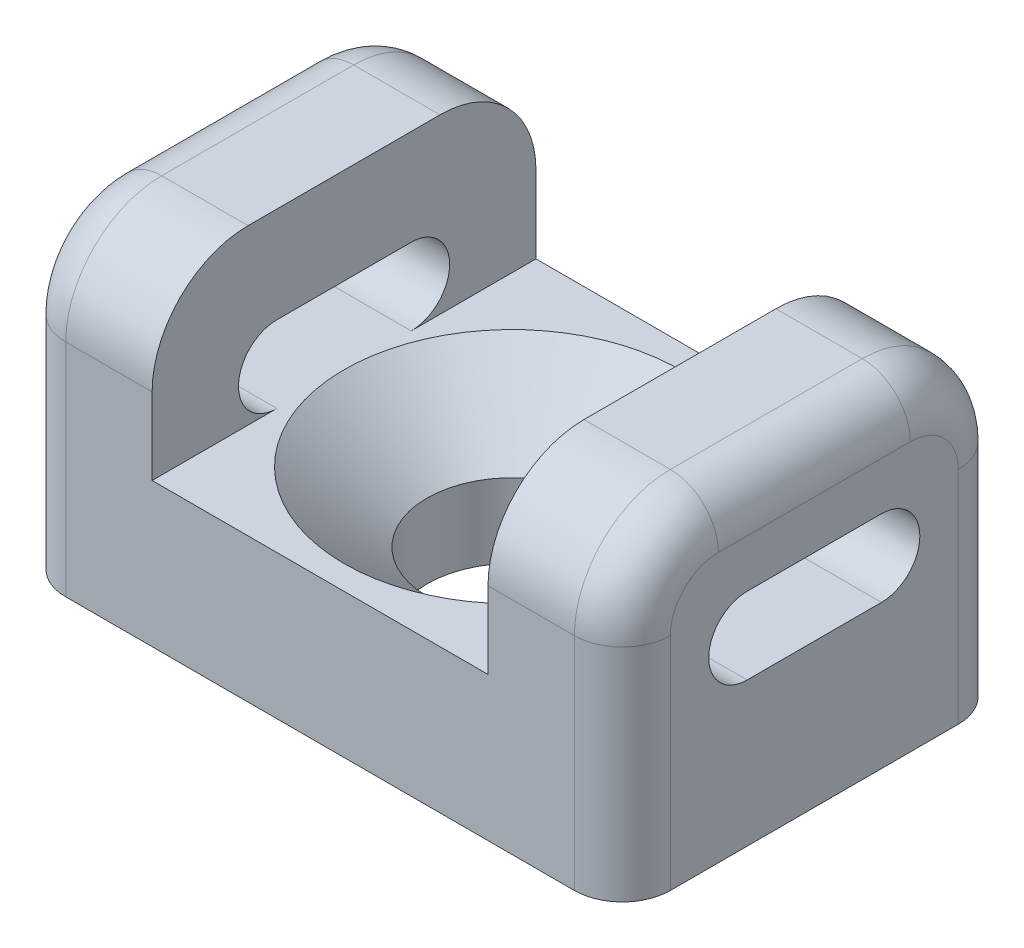
ISO-10303-21;
HEADER;
FILE_DESCRIPTION(('STEP AP214'),'2;1');
FILE_NAME('part.step','',(''),(''),'','','');
FILE_SCHEMA(('AUTOMOTIVE_DESIGN { 1 0 10303 214 1 1 1 1 }'));
ENDSEC;
DATA;
#1=APPLICATION_CONTEXT('core data for automotive mechanical design processes');
#2=APPLICATION_PROTOCOL_DEFINITION('international standard','automotive_design',2000,#1);
#3=PRODUCT_CONTEXT('',#1,'mechanical');
#4=PRODUCT('Part','Part','',(#3));
#5=PRODUCT_RELATED_PRODUCT_CATEGORY('part','',(#4));
#6=PRODUCT_DEFINITION_FORMATION('','',#4);
#7=PRODUCT_DEFINITION_CONTEXT('part definition',#1,'design');
#8=PRODUCT_DEFINITION('design','',#6,#7);
#9=PRODUCT_DEFINITION_SHAPE('','',#8);
#10=(LENGTH_UNIT() NAMED_UNIT(*) SI_UNIT(.MILLI.,.METRE.));
#11=(NAMED_UNIT(*) PLANE_ANGLE_UNIT() SI_UNIT($,.RADIAN.));
#12=(NAMED_UNIT(*) SI_UNIT($,.STERADIAN.) SOLID_ANGLE_UNIT());
#13=UNCERTAINTY_MEASURE_WITH_UNIT(LENGTH_MEASURE(1.E-05),#10,'distance_accuracy_value','');
#14=(GEOMETRIC_REPRESENTATION_CONTEXT(3) GLOBAL_UNCERTAINTY_ASSIGNED_CONTEXT((#13)) GLOBAL_UNIT_ASSIGNED_CONTEXT((#10,
#11,#12)) REPRESENTATION_CONTEXT('',''));
#15=CARTESIAN_POINT('',(0.,0.,0.));
#16=DIRECTION('',(0.,0.,1.));
#17=DIRECTION('',(1.,0.,0.));
#18=AXIS2_PLACEMENT_3D('',#15,#16,#17);
#19=CARTESIAN_POINT('',(0.,0.,5.08));
#20=DIRECTION('',(0.,-1.,0.));
#21=DIRECTION('',(0.,0.,-1.));
#22=AXIS2_PLACEMENT_3D('',#19,#20,#21);
#23=PLANE('',#22);
#24=DIRECTION('',(-1.,0.,0.));
#25=VECTOR('',#24,1.);
#26=CARTESIAN_POINT('',(0.,0.,-5.08));
#27=LINE('',#26,#25);
#28=CARTESIAN_POINT('',(4.445,0.,-5.08));
#29=VERTEX_POINT('',#28);
#30=CARTESIAN_POINT('',(-4.445,0.,-5.08));
#31=VERTEX_POINT('',#30);
#32=EDGE_CURVE('E363',#29,#31,#27,.T.);
#33=ORIENTED_EDGE('',*,*,#32,.T.);
#34=DIRECTION('',(0.,0.,-1.));
#35=VECTOR('',#34,1.);
#36=CARTESIAN_POINT('',(-4.445,0.,5.08));
#37=LINE('',#36,#35);
#38=CARTESIAN_POINT('',(-4.445,0.,-1.778));
#39=VERTEX_POINT('',#38);
#40=EDGE_CURVE('E236',#39,#31,#37,.T.);
#41=ORIENTED_EDGE('',*,*,#40,.F.);
#42=DIRECTION('',(1.,0.,0.));
#43=VECTOR('',#42,1.);
#44=CARTESIAN_POINT('',(-8.001,0.,-1.778));
#45=LINE('',#44,#43);
#46=CARTESIAN_POINT('',(-8.001,0.,-1.778));
#47=VERTEX_POINT('',#46);
#48=EDGE_CURVE('E216',#47,#39,#45,.T.);
#49=ORIENTED_EDGE('',*,*,#48,.F.);
#50=DIRECTION('',(0.,0.,1.));
#51=VECTOR('',#50,1.);
#52=CARTESIAN_POINT('',(-8.001,0.,-1.778));
#53=LINE('',#52,#51);
#54=CARTESIAN_POINT('',(-8.001,0.,1.778));
#55=VERTEX_POINT('',#54);
#56=EDGE_CURVE('E222',#47,#55,#53,.T.);
#57=ORIENTED_EDGE('',*,*,#56,.T.);
#58=DIRECTION('',(1.,0.,0.));
#59=VECTOR('',#58,1.);
#60=CARTESIAN_POINT('',(-8.001,0.,1.778));
#61=LINE('',#60,#59);
#62=CARTESIAN_POINT('',(-4.445,0.,1.778));
#63=VERTEX_POINT('',#62);
#64=EDGE_CURVE('E237',#55,#63,#61,.T.);
#65=ORIENTED_EDGE('',*,*,#64,.T.);
#66=CARTESIAN_POINT('',(-4.445,0.,5.08));
#67=VERTEX_POINT('',#66);
#68=EDGE_CURVE('E251',#67,#63,#37,.T.);
#69=ORIENTED_EDGE('',*,*,#68,.F.);
#70=DIRECTION('',(-1.,0.,0.));
#71=VECTOR('',#70,1.);
#72=CARTESIAN_POINT('',(0.,0.,5.08));
#73=LINE('',#72,#71);
#74=CARTESIAN_POINT('',(4.445,0.,5.08));
#75=VERTEX_POINT('',#74);
#76=EDGE_CURVE('E365',#75,#67,#73,.T.);
#77=ORIENTED_EDGE('',*,*,#76,.F.);
#78=DIRECTION('',(0.,0.,-1.));
#79=VECTOR('',#78,1.);
#80=CARTESIAN_POINT('',(4.445,0.,5.08));
#81=LINE('',#80,#79);
#82=CARTESIAN_POINT('',(4.445,0.,1.778));
#83=VERTEX_POINT('',#82);
#84=EDGE_CURVE('E373',#75,#83,#81,.T.);
#85=ORIENTED_EDGE('',*,*,#84,.T.);
#86=DIRECTION('',(-1.,0.,0.));
#87=VECTOR('',#86,1.);
#88=CARTESIAN_POINT('',(8.001,0.,1.778));
#89=LINE('',#88,#87);
#90=CARTESIAN_POINT('',(8.001,0.,1.778));
#91=VERTEX_POINT('',#90);
#92=EDGE_CURVE('E347',#91,#83,#89,.T.);
#93=ORIENTED_EDGE('',*,*,#92,.F.);
#94=DIRECTION('',(0.,0.,1.));
#95=VECTOR('',#94,1.);
#96=CARTESIAN_POINT('',(8.001,0.,-1.778));
#97=LINE('',#96,#95);
#98=CARTESIAN_POINT('',(8.001,0.,-1.778));
#99=VERTEX_POINT('',#98);
#100=EDGE_CURVE('E324',#99,#91,#97,.T.);
#101=ORIENTED_EDGE('',*,*,#100,.F.);
#102=DIRECTION('',(-1.,0.,0.));
#103=VECTOR('',#102,1.);
#104=CARTESIAN_POINT('',(8.001,0.,-1.778));
#105=LINE('',#104,#103);
#106=CARTESIAN_POINT('',(4.445,0.,-1.778));
#107=VERTEX_POINT('',#106);
#108=EDGE_CURVE('E334',#99,#107,#105,.T.);
#109=ORIENTED_EDGE('',*,*,#108,.T.);
#110=EDGE_CURVE('E367',#107,#29,#81,.T.);
#111=ORIENTED_EDGE('',*,*,#110,.T.);
#112=EDGE_LOOP('',(#33,#41,#49,#57,#65,#69,#77,#85,#93,#101,#109,#111));
#113=FACE_BOUND('',#112,.T.);
#114=CARTESIAN_POINT('',(0.,0.,0.));
#115=DIRECTION('',(0.,1.,0.));
#116=DIRECTION('',(0.,0.,1.));
#117=AXIS2_PLACEMENT_3D('',#114,#115,#116);
#118=CIRCLE('',#117,4.445);
#119=CARTESIAN_POINT('',(0.,0.,4.445));
#120=VERTEX_POINT('',#119);
#121=EDGE_CURVE('E344',#120,#120,#118,.T.);
#122=ORIENTED_EDGE('',*,*,#121,.F.);
#123=EDGE_LOOP('',(#122));
#124=FACE_BOUND('',#123,.T.);
#125=ADVANCED_FACE('F37',(#113,#124),#23,.F.);
#126=CARTESIAN_POINT('',(8.001,-3.81,5.08));
#127=DIRECTION('',(0.,1.,0.));
#128=DIRECTION('',(-1.,0.,0.));
#129=AXIS2_PLACEMENT_3D('',#126,#127,#128);
#130=PLANE('',#129);
#131=CARTESIAN_POINT('',(-6.731,-3.81,-3.81));
#132=DIRECTION('',(0.,-1.,0.));
#133=DIRECTION('',(1.,0.,0.));
#134=AXIS2_PLACEMENT_3D('',#131,#132,#133);
#135=CIRCLE('',#134,1.27);
#136=CARTESIAN_POINT('',(-6.731,-3.81,-5.08));
#137=VERTEX_POINT('',#136);
#138=CARTESIAN_POINT('',(-8.001,-3.81,-3.81));
#139=VERTEX_POINT('',#138);
#140=EDGE_CURVE('E296',#137,#139,#135,.F.);
#141=ORIENTED_EDGE('',*,*,#140,.F.);
#142=DIRECTION('',(1.,0.,0.));
#143=VECTOR('',#142,1.);
#144=CARTESIAN_POINT('',(8.001,-3.81,-5.08));
#145=LINE('',#144,#143);
#146=CARTESIAN_POINT('',(6.731,-3.81,-5.08));
#147=VERTEX_POINT('',#146);
#148=EDGE_CURVE('E359',#137,#147,#145,.T.);
#149=ORIENTED_EDGE('',*,*,#148,.T.);
#150=CARTESIAN_POINT('',(6.731,-3.81,-3.81));
#151=DIRECTION('',(0.,1.,0.));
#152=DIRECTION('',(-1.,0.,0.));
#153=AXIS2_PLACEMENT_3D('',#150,#151,#152);
#154=CIRCLE('',#153,1.27);
#155=CARTESIAN_POINT('',(8.001,-3.81,-3.81));
#156=VERTEX_POINT('',#155);
#157=EDGE_CURVE('E410',#147,#156,#154,.F.);
#158=ORIENTED_EDGE('',*,*,#157,.T.);
#159=DIRECTION('',(0.,0.,-1.));
#160=VECTOR('',#159,1.);
#161=CARTESIAN_POINT('',(8.001,-3.81,5.08));
#162=LINE('',#161,#160);
#163=CARTESIAN_POINT('',(8.001,-3.81,3.81));
#164=VERTEX_POINT('',#163);
#165=EDGE_CURVE('E379',#164,#156,#162,.T.);
#166=ORIENTED_EDGE('',*,*,#165,.F.);
#167=CARTESIAN_POINT('',(6.731,-3.81,3.81));
#168=DIRECTION('',(0.,1.,0.));
#169=DIRECTION('',(-1.,0.,0.));
#170=AXIS2_PLACEMENT_3D('',#167,#168,#169);
#171=CIRCLE('',#170,1.27);
#172=CARTESIAN_POINT('',(6.731,-3.81,5.08));
#173=VERTEX_POINT('',#172);
#174=EDGE_CURVE('E408',#164,#173,#171,.F.);
#175=ORIENTED_EDGE('',*,*,#174,.T.);
#176=DIRECTION('',(1.,0.,0.));
#177=VECTOR('',#176,1.);
#178=CARTESIAN_POINT('',(8.001,-3.81,5.08));
#179=LINE('',#178,#177);
#180=CARTESIAN_POINT('',(-6.731,-3.81,5.08));
#181=VERTEX_POINT('',#180);
#182=EDGE_CURVE('E360',#181,#173,#179,.T.);
#183=ORIENTED_EDGE('',*,*,#182,.F.);
#184=CARTESIAN_POINT('',(-6.731,-3.81,3.81));
#185=DIRECTION('',(0.,-1.,0.));
#186=DIRECTION('',(1.,0.,0.));
#187=AXIS2_PLACEMENT_3D('',#184,#185,#186);
#188=CIRCLE('',#187,1.27);
#189=CARTESIAN_POINT('',(-8.001,-3.81,3.81));
#190=VERTEX_POINT('',#189);
#191=EDGE_CURVE('E293',#190,#181,#188,.F.);
#192=ORIENTED_EDGE('',*,*,#191,.F.);
#193=DIRECTION('',(0.,0.,-1.));
#194=VECTOR('',#193,1.);
#195=CARTESIAN_POINT('',(-8.001,-3.81,5.08));
#196=LINE('',#195,#194);
#197=EDGE_CURVE('E257',#190,#139,#196,.T.);
#198=ORIENTED_EDGE('',*,*,#197,.T.);
#199=EDGE_LOOP('',(#141,#149,#158,#166,#175,#183,#192,#198));
#200=FACE_BOUND('',#199,.T.);
#201=CARTESIAN_POINT('',(0.,-3.81,0.));
#202=DIRECTION('',(0.,1.,0.));
#203=DIRECTION('',(0.,0.,1.));
#204=AXIS2_PLACEMENT_3D('',#201,#202,#203);
#205=CIRCLE('',#204,2.2479);
#206=CARTESIAN_POINT('',(0.,-3.81,2.2479));
#207=VERTEX_POINT('',#206);
#208=EDGE_CURVE('E356',#207,#207,#205,.T.);
#209=ORIENTED_EDGE('',*,*,#208,.T.);
#210=EDGE_LOOP('',(#209));
#211=FACE_BOUND('',#210,.T.);
#212=ADVANCED_FACE('F440',(#200,#211),#130,.F.);
#213=CARTESIAN_POINT('',(8.001,4.572,5.08));
#214=DIRECTION('',(-1.,0.,0.));
#215=DIRECTION('',(0.,-1.,0.));
#216=AXIS2_PLACEMENT_3D('',#213,#214,#215);
#217=PLANE('',#216);
#218=DIRECTION('',(0.,0.,-1.));
#219=VECTOR('',#218,1.);
#220=CARTESIAN_POINT('',(8.001,2.032,-1.778));
#221=LINE('',#220,#219);
#222=CARTESIAN_POINT('',(8.001,2.032,1.778));
#223=VERTEX_POINT('',#222);
#224=CARTESIAN_POINT('',(8.001,2.032,-1.778));
#225=VERTEX_POINT('',#224);
#226=EDGE_CURVE('E331',#223,#225,#221,.T.);
#227=ORIENTED_EDGE('',*,*,#226,.T.);
#228=CARTESIAN_POINT('',(8.001,1.016,-1.778));
#229=DIRECTION('',(-1.,0.,0.));
#230=DIRECTION('',(0.,0.,1.));
#231=AXIS2_PLACEMENT_3D('',#228,#229,#230);
#232=CIRCLE('',#231,1.016);
#233=EDGE_CURVE('E321',#225,#99,#232,.T.);
#234=ORIENTED_EDGE('',*,*,#233,.T.);
#235=ORIENTED_EDGE('',*,*,#100,.T.);
#236=CARTESIAN_POINT('',(8.001,1.016,1.778));
#237=DIRECTION('',(-1.,0.,0.));
#238=DIRECTION('',(0.,0.,1.));
#239=AXIS2_PLACEMENT_3D('',#236,#237,#238);
#240=CIRCLE('',#239,1.016);
#241=EDGE_CURVE('E328',#91,#223,#240,.T.);
#242=ORIENTED_EDGE('',*,*,#241,.T.);
#243=EDGE_LOOP('',(#227,#234,#235,#242));
#244=FACE_BOUND('',#243,.T.);
#245=ORIENTED_EDGE('',*,*,#165,.T.);
#246=DIRECTION('',(0.,1.,0.));
#247=VECTOR('',#246,1.);
#248=CARTESIAN_POINT('',(8.001,2.032,-3.81));
#249=LINE('',#248,#247);
#250=CARTESIAN_POINT('',(8.001,2.032,-3.81));
#251=VERTEX_POINT('',#250);
#252=EDGE_CURVE('E403',#156,#251,#249,.T.);
#253=ORIENTED_EDGE('',*,*,#252,.T.);
#254=CARTESIAN_POINT('',(8.001,2.032,-2.54));
#255=DIRECTION('',(-1.,0.,0.));
#256=DIRECTION('',(0.,-1.,0.));
#257=AXIS2_PLACEMENT_3D('',#254,#255,#256);
#258=CIRCLE('',#257,1.27);
#259=CARTESIAN_POINT('',(8.001,3.302,-2.54));
#260=VERTEX_POINT('',#259);
#261=EDGE_CURVE('E401',#251,#260,#258,.F.);
#262=ORIENTED_EDGE('',*,*,#261,.T.);
#263=DIRECTION('',(0.,0.,-1.));
#264=VECTOR('',#263,1.);
#265=CARTESIAN_POINT('',(8.001,3.302,5.08));
#266=LINE('',#265,#264);
#267=CARTESIAN_POINT('',(8.001,3.302,2.54));
#268=VERTEX_POINT('',#267);
#269=EDGE_CURVE('E399',#260,#268,#266,.F.);
#270=ORIENTED_EDGE('',*,*,#269,.T.);
#271=CARTESIAN_POINT('',(8.001,2.032,2.54));
#272=DIRECTION('',(-1.,0.,0.));
#273=DIRECTION('',(0.,-1.,0.));
#274=AXIS2_PLACEMENT_3D('',#271,#272,#273);
#275=CIRCLE('',#274,1.27);
#276=CARTESIAN_POINT('',(8.001,2.032,3.81));
#277=VERTEX_POINT('',#276);
#278=EDGE_CURVE('E397',#268,#277,#275,.F.);
#279=ORIENTED_EDGE('',*,*,#278,.T.);
#280=DIRECTION('',(0.,1.,0.));
#281=VECTOR('',#280,1.);
#282=CARTESIAN_POINT('',(8.001,4.572,3.81));
#283=LINE('',#282,#281);
#284=EDGE_CURVE('E395',#277,#164,#283,.F.);
#285=ORIENTED_EDGE('',*,*,#284,.T.);
#286=EDGE_LOOP('',(#245,#253,#262,#270,#279,#285));
#287=FACE_BOUND('',#286,.T.);
#288=ADVANCED_FACE('F436',(#244,#287),#217,.F.);
#289=CARTESIAN_POINT('',(4.445,4.572,5.08));
#290=DIRECTION('',(0.,-1.,0.));
#291=DIRECTION('',(0.,0.,-1.));
#292=AXIS2_PLACEMENT_3D('',#289,#290,#291);
#293=PLANE('',#292);
#294=DIRECTION('',(-1.,0.,0.));
#295=VECTOR('',#294,1.);
#296=CARTESIAN_POINT('',(4.445,4.572,2.54));
#297=LINE('',#296,#295);
#298=CARTESIAN_POINT('',(4.445,4.572,2.54));
#299=VERTEX_POINT('',#298);
#300=CARTESIAN_POINT('',(6.731,4.572,2.54));
#301=VERTEX_POINT('',#300);
#302=EDGE_CURVE('E382',#299,#301,#297,.F.);
#303=ORIENTED_EDGE('',*,*,#302,.T.);
#304=DIRECTION('',(0.,0.,-1.));
#305=VECTOR('',#304,1.);
#306=CARTESIAN_POINT('',(6.731,4.572,5.08));
#307=LINE('',#306,#305);
#308=CARTESIAN_POINT('',(6.731,4.572,-2.54));
#309=VERTEX_POINT('',#308);
#310=EDGE_CURVE('E414',#301,#309,#307,.T.);
#311=ORIENTED_EDGE('',*,*,#310,.T.);
#312=DIRECTION('',(-1.,0.,0.));
#313=VECTOR('',#312,1.);
#314=CARTESIAN_POINT('',(4.445,4.572,-2.54));
#315=LINE('',#314,#313);
#316=CARTESIAN_POINT('',(4.445,4.572,-2.54));
#317=VERTEX_POINT('',#316);
#318=EDGE_CURVE('E384',#309,#317,#315,.T.);
#319=ORIENTED_EDGE('',*,*,#318,.T.);
#320=DIRECTION('',(0.,0.,-1.));
#321=VECTOR('',#320,1.);
#322=CARTESIAN_POINT('',(4.445,4.572,5.08));
#323=LINE('',#322,#321);
#324=EDGE_CURVE('E376',#299,#317,#323,.T.);
#325=ORIENTED_EDGE('',*,*,#324,.F.);
#326=EDGE_LOOP('',(#303,#311,#319,#325));
#327=FACE_BOUND('',#326,.T.);
#328=ADVANCED_FACE('F483',(#327),#293,.F.);
#329=CARTESIAN_POINT('',(4.445,0.,5.08));
#330=DIRECTION('',(1.,0.,0.));
#331=DIRECTION('',(0.,0.,-1.));
#332=AXIS2_PLACEMENT_3D('',#329,#330,#331);
#333=PLANE('',#332);
#334=ORIENTED_EDGE('',*,*,#324,.T.);
#335=CARTESIAN_POINT('',(4.445,2.032,-2.54));
#336=DIRECTION('',(1.,0.,0.));
#337=DIRECTION('',(0.,0.,-1.));
#338=AXIS2_PLACEMENT_3D('',#335,#336,#337);
#339=CIRCLE('',#338,2.54);
#340=CARTESIAN_POINT('',(4.445,2.032,-5.08));
#341=VERTEX_POINT('',#340);
#342=EDGE_CURVE('E388',#317,#341,#339,.F.);
#343=ORIENTED_EDGE('',*,*,#342,.T.);
#344=DIRECTION('',(0.,-1.,0.));
#345=VECTOR('',#344,1.);
#346=CARTESIAN_POINT('',(4.445,0.,-5.08));
#347=LINE('',#346,#345);
#348=EDGE_CURVE('E370',#341,#29,#347,.T.);
#349=ORIENTED_EDGE('',*,*,#348,.T.);
#350=ORIENTED_EDGE('',*,*,#110,.F.);
#351=CARTESIAN_POINT('',(4.445,1.016,-1.778));
#352=DIRECTION('',(-1.,0.,0.));
#353=DIRECTION('',(0.,0.,1.));
#354=AXIS2_PLACEMENT_3D('',#351,#352,#353);
#355=CIRCLE('',#354,1.016);
#356=CARTESIAN_POINT('',(4.445,2.032,-1.778));
#357=VERTEX_POINT('',#356);
#358=EDGE_CURVE('E335',#357,#107,#355,.T.);
#359=ORIENTED_EDGE('',*,*,#358,.F.);
#360=DIRECTION('',(0.,0.,-1.));
#361=VECTOR('',#360,1.);
#362=CARTESIAN_POINT('',(4.445,2.032,-1.778));
#363=LINE('',#362,#361);
#364=CARTESIAN_POINT('',(4.445,2.032,1.778));
#365=VERTEX_POINT('',#364);
#366=EDGE_CURVE('E325',#365,#357,#363,.T.);
#367=ORIENTED_EDGE('',*,*,#366,.F.);
#368=CARTESIAN_POINT('',(4.445,1.016,1.778));
#369=DIRECTION('',(-1.,0.,0.));
#370=DIRECTION('',(0.,0.,1.));
#371=AXIS2_PLACEMENT_3D('',#368,#369,#370);
#372=CIRCLE('',#371,1.016);
#373=EDGE_CURVE('E337',#83,#365,#372,.T.);
#374=ORIENTED_EDGE('',*,*,#373,.F.);
#375=ORIENTED_EDGE('',*,*,#84,.F.);
#376=DIRECTION('',(0.,-1.,0.));
#377=VECTOR('',#376,1.);
#378=CARTESIAN_POINT('',(4.445,0.,5.08));
#379=LINE('',#378,#377);
#380=CARTESIAN_POINT('',(4.445,2.032,5.08));
#381=VERTEX_POINT('',#380);
#382=EDGE_CURVE('E362',#381,#75,#379,.T.);
#383=ORIENTED_EDGE('',*,*,#382,.F.);
#384=CARTESIAN_POINT('',(4.445,2.032,2.54));
#385=DIRECTION('',(1.,0.,0.));
#386=DIRECTION('',(0.,0.,-1.));
#387=AXIS2_PLACEMENT_3D('',#384,#385,#386);
#388=CIRCLE('',#387,2.54);
#389=EDGE_CURVE('E386',#381,#299,#388,.F.);
#390=ORIENTED_EDGE('',*,*,#389,.T.);
#391=EDGE_LOOP('',(#334,#343,#349,#350,#359,#367,#374,#375,#383,#390));
#392=FACE_BOUND('',#391,.T.);
#393=ADVANCED_FACE('F465',(#392),#333,.F.);
#394=CARTESIAN_POINT('',(0.,0.,5.08));
#395=DIRECTION('',(0.,0.,-1.));
#396=DIRECTION('',(-1.,0.,0.));
#397=AXIS2_PLACEMENT_3D('',#394,#395,#396);
#398=PLANE('',#397);
#399=ORIENTED_EDGE('',*,*,#182,.T.);
#400=DIRECTION('',(0.,1.,0.));
#401=VECTOR('',#400,1.);
#402=CARTESIAN_POINT('',(6.731,0.,5.08));
#403=LINE('',#402,#401);
#404=CARTESIAN_POINT('',(6.731,2.032,5.08));
#405=VERTEX_POINT('',#404);
#406=EDGE_CURVE('E11',#173,#405,#403,.T.);
#407=ORIENTED_EDGE('',*,*,#406,.T.);
#408=DIRECTION('',(-1.,0.,0.));
#409=VECTOR('',#408,1.);
#410=CARTESIAN_POINT('',(0.,2.032,5.08));
#411=LINE('',#410,#409);
#412=EDGE_CURVE('E393',#405,#381,#411,.T.);
#413=ORIENTED_EDGE('',*,*,#412,.T.);
#414=ORIENTED_EDGE('',*,*,#382,.T.);
#415=ORIENTED_EDGE('',*,*,#76,.T.);
#416=DIRECTION('',(0.,-1.,0.));
#417=VECTOR('',#416,1.);
#418=CARTESIAN_POINT('',(-4.445,0.,5.08));
#419=LINE('',#418,#417);
#420=CARTESIAN_POINT('',(-4.445,2.032,5.08));
#421=VERTEX_POINT('',#420);
#422=EDGE_CURVE('E245',#421,#67,#419,.T.);
#423=ORIENTED_EDGE('',*,*,#422,.F.);
#424=DIRECTION('',(1.,0.,0.));
#425=VECTOR('',#424,1.);
#426=CARTESIAN_POINT('',(0.,2.032,5.08));
#427=LINE('',#426,#425);
#428=CARTESIAN_POINT('',(-6.731,2.032,5.08));
#429=VERTEX_POINT('',#428);
#430=EDGE_CURVE('E274',#429,#421,#427,.T.);
#431=ORIENTED_EDGE('',*,*,#430,.F.);
#432=DIRECTION('',(0.,1.,0.));
#433=VECTOR('',#432,1.);
#434=CARTESIAN_POINT('',(-6.731,0.,5.08));
#435=LINE('',#434,#433);
#436=EDGE_CURVE('E308',#181,#429,#435,.T.);
#437=ORIENTED_EDGE('',*,*,#436,.F.);
#438=EDGE_LOOP('',(#399,#407,#413,#414,#415,#423,#431,#437));
#439=FACE_BOUND('',#438,.T.);
#440=ADVANCED_FACE('F500',(#439),#398,.F.);
#441=CARTESIAN_POINT('',(0.,0.,-5.08));
#442=DIRECTION('',(0.,0.,-1.));
#443=DIRECTION('',(-1.,0.,0.));
#444=AXIS2_PLACEMENT_3D('',#441,#442,#443);
#445=PLANE('',#444);
#446=DIRECTION('',(-1.,0.,0.));
#447=VECTOR('',#446,1.);
#448=CARTESIAN_POINT('',(8.001,2.032,-5.08));
#449=LINE('',#448,#447);
#450=CARTESIAN_POINT('',(6.731,2.032,-5.08));
#451=VERTEX_POINT('',#450);
#452=EDGE_CURVE('E390',#341,#451,#449,.F.);
#453=ORIENTED_EDGE('',*,*,#452,.T.);
#454=DIRECTION('',(0.,1.,0.));
#455=VECTOR('',#454,1.);
#456=CARTESIAN_POINT('',(6.731,-3.81,-5.08));
#457=LINE('',#456,#455);
#458=EDGE_CURVE('E406',#451,#147,#457,.F.);
#459=ORIENTED_EDGE('',*,*,#458,.T.);
#460=ORIENTED_EDGE('',*,*,#148,.F.);
#461=DIRECTION('',(0.,1.,0.));
#462=VECTOR('',#461,1.);
#463=CARTESIAN_POINT('',(-6.731,-3.81,-5.08));
#464=LINE('',#463,#462);
#465=CARTESIAN_POINT('',(-6.731,2.032,-5.08));
#466=VERTEX_POINT('',#465);
#467=EDGE_CURVE('E290',#466,#137,#464,.F.);
#468=ORIENTED_EDGE('',*,*,#467,.F.);
#469=DIRECTION('',(1.,0.,0.));
#470=VECTOR('',#469,1.);
#471=CARTESIAN_POINT('',(-8.001,2.032,-5.08));
#472=LINE('',#471,#470);
#473=CARTESIAN_POINT('',(-4.445,2.032,-5.08));
#474=VERTEX_POINT('',#473);
#475=EDGE_CURVE('E271',#474,#466,#472,.F.);
#476=ORIENTED_EDGE('',*,*,#475,.F.);
#477=DIRECTION('',(0.,-1.,0.));
#478=VECTOR('',#477,1.);
#479=CARTESIAN_POINT('',(-4.445,0.,-5.08));
#480=LINE('',#479,#478);
#481=EDGE_CURVE('E248',#474,#31,#480,.T.);
#482=ORIENTED_EDGE('',*,*,#481,.T.);
#483=ORIENTED_EDGE('',*,*,#32,.F.);
#484=ORIENTED_EDGE('',*,*,#348,.F.);
#485=EDGE_LOOP('',(#453,#459,#460,#468,#476,#482,#483,#484));
#486=FACE_BOUND('',#485,.T.);
#487=ADVANCED_FACE('F460',(#486),#445,.T.);
#488=CARTESIAN_POINT('',(0.,0.,0.));
#489=DIRECTION('',(0.,1.,0.));
#490=DIRECTION('',(0.,0.,1.));
#491=AXIS2_PLACEMENT_3D('',#488,#489,#490);
#492=CYLINDRICAL_SURFACE('',#491,2.24789999999999);
#493=CARTESIAN_POINT('',(0.,-1.8435857996596,0.));
#494=DIRECTION('',(0.,1.,0.));
#495=DIRECTION('',(0.,0.,1.));
#496=AXIS2_PLACEMENT_3D('',#493,#494,#495);
#497=CIRCLE('',#496,2.24789999999999);
#498=CARTESIAN_POINT('',(0.,-1.8435857996596,2.24789999999999));
#499=VERTEX_POINT('',#498);
#500=EDGE_CURVE('E353',#499,#499,#497,.T.);
#501=ORIENTED_EDGE('',*,*,#500,.T.);
#502=EDGE_LOOP('',(#501));
#503=FACE_BOUND('',#502,.T.);
#504=ORIENTED_EDGE('',*,*,#208,.F.);
#505=EDGE_LOOP('',(#504));
#506=FACE_BOUND('',#505,.T.);
#507=ADVANCED_FACE('F507',(#503,#506),#492,.F.);
#508=CARTESIAN_POINT('',(0.,0.,0.));
#509=DIRECTION('',(0.,1.,0.));
#510=DIRECTION('',(0.,0.,1.));
#511=AXIS2_PLACEMENT_3D('',#508,#509,#510);
#512=CONICAL_SURFACE('',#511,4.445,0.872664625997168);
#513=ORIENTED_EDGE('',*,*,#121,.T.);
#514=EDGE_LOOP('',(#513));
#515=FACE_BOUND('',#514,.T.);
#516=ORIENTED_EDGE('',*,*,#500,.F.);
#517=EDGE_LOOP('',(#516));
#518=FACE_BOUND('',#517,.T.);
#519=ADVANCED_FACE('F511',(#515,#518),#512,.F.);
#520=CARTESIAN_POINT('',(8.001,1.016,-1.778));
#521=DIRECTION('',(-1.,0.,0.));
#522=DIRECTION('',(0.,0.,1.));
#523=AXIS2_PLACEMENT_3D('',#520,#521,#522);
#524=CYLINDRICAL_SURFACE('',#523,1.016);
#525=ORIENTED_EDGE('',*,*,#358,.T.);
#526=ORIENTED_EDGE('',*,*,#108,.F.);
#527=ORIENTED_EDGE('',*,*,#233,.F.);
#528=DIRECTION('',(-1.,0.,0.));
#529=VECTOR('',#528,1.);
#530=CARTESIAN_POINT('',(8.001,2.032,-1.778));
#531=LINE('',#530,#529);
#532=EDGE_CURVE('E342',#225,#357,#531,.T.);
#533=ORIENTED_EDGE('',*,*,#532,.T.);
#534=EDGE_LOOP('',(#525,#526,#527,#533));
#535=FACE_BOUND('',#534,.T.);
#536=ADVANCED_FACE('F471',(#535),#524,.F.);
#537=CARTESIAN_POINT('',(8.001,2.032,-1.778));
#538=DIRECTION('',(0.,1.,0.));
#539=DIRECTION('',(0.,0.,1.));
#540=AXIS2_PLACEMENT_3D('',#537,#538,#539);
#541=PLANE('',#540);
#542=ORIENTED_EDGE('',*,*,#366,.T.);
#543=ORIENTED_EDGE('',*,*,#532,.F.);
#544=ORIENTED_EDGE('',*,*,#226,.F.);
#545=DIRECTION('',(-1.,0.,0.));
#546=VECTOR('',#545,1.);
#547=CARTESIAN_POINT('',(8.001,2.032,1.778));
#548=LINE('',#547,#546);
#549=EDGE_CURVE('E345',#223,#365,#548,.T.);
#550=ORIENTED_EDGE('',*,*,#549,.T.);
#551=EDGE_LOOP('',(#542,#543,#544,#550));
#552=FACE_BOUND('',#551,.T.);
#553=ADVANCED_FACE('F476',(#552),#541,.F.);
#554=CARTESIAN_POINT('',(8.001,1.016,1.778));
#555=DIRECTION('',(-1.,0.,0.));
#556=DIRECTION('',(0.,0.,1.));
#557=AXIS2_PLACEMENT_3D('',#554,#555,#556);
#558=CYLINDRICAL_SURFACE('',#557,1.016);
#559=ORIENTED_EDGE('',*,*,#373,.T.);
#560=ORIENTED_EDGE('',*,*,#549,.F.);
#561=ORIENTED_EDGE('',*,*,#241,.F.);
#562=ORIENTED_EDGE('',*,*,#92,.T.);
#563=EDGE_LOOP('',(#559,#560,#561,#562));
#564=FACE_BOUND('',#563,.T.);
#565=ADVANCED_FACE('F479',(#564),#558,.F.);
#566=CARTESIAN_POINT('',(4.445,2.032,-2.54));
#567=DIRECTION('',(1.,0.,0.));
#568=DIRECTION('',(0.,0.,-1.));
#569=AXIS2_PLACEMENT_3D('',#566,#567,#568);
#570=CYLINDRICAL_SURFACE('',#569,2.54);
#571=ORIENTED_EDGE('',*,*,#318,.F.);
#572=CARTESIAN_POINT('',(6.731,2.032,-2.54));
#573=DIRECTION('',(-1.,0.,0.));
#574=DIRECTION('',(0.,-1.,0.));
#575=AXIS2_PLACEMENT_3D('',#572,#573,#574);
#576=CIRCLE('',#575,2.54);
#577=EDGE_CURVE('E412',#309,#451,#576,.T.);
#578=ORIENTED_EDGE('',*,*,#577,.T.);
#579=ORIENTED_EDGE('',*,*,#452,.F.);
#580=ORIENTED_EDGE('',*,*,#342,.F.);
#581=EDGE_LOOP('',(#571,#578,#579,#580));
#582=FACE_BOUND('',#581,.T.);
#583=ADVANCED_FACE('F456',(#582),#570,.T.);
#584=CARTESIAN_POINT('',(0.,2.032,2.54));
#585=DIRECTION('',(-1.,0.,0.));
#586=DIRECTION('',(0.,0.,1.));
#587=AXIS2_PLACEMENT_3D('',#584,#585,#586);
#588=CYLINDRICAL_SURFACE('',#587,2.54);
#589=ORIENTED_EDGE('',*,*,#412,.F.);
#590=CARTESIAN_POINT('',(6.731,2.032,2.54));
#591=DIRECTION('',(-1.,0.,0.));
#592=DIRECTION('',(0.,-1.,0.));
#593=AXIS2_PLACEMENT_3D('',#590,#591,#592);
#594=CIRCLE('',#593,2.54);
#595=EDGE_CURVE('E46',#405,#301,#594,.T.);
#596=ORIENTED_EDGE('',*,*,#595,.T.);
#597=ORIENTED_EDGE('',*,*,#302,.F.);
#598=ORIENTED_EDGE('',*,*,#389,.F.);
#599=EDGE_LOOP('',(#589,#596,#597,#598));
#600=FACE_BOUND('',#599,.T.);
#601=ADVANCED_FACE('F602',(#600),#588,.T.);
#602=CARTESIAN_POINT('',(6.731,0.,3.81));
#603=DIRECTION('',(0.,1.,0.));
#604=DIRECTION('',(-1.,0.,0.));
#605=AXIS2_PLACEMENT_3D('',#602,#603,#604);
#606=CYLINDRICAL_SURFACE('',#605,1.27);
#607=ORIENTED_EDGE('',*,*,#174,.F.);
#608=ORIENTED_EDGE('',*,*,#284,.F.);
#609=CARTESIAN_POINT('',(6.731,2.032,3.81));
#610=DIRECTION('',(0.,1.,0.));
#611=DIRECTION('',(-1.,0.,0.));
#612=AXIS2_PLACEMENT_3D('',#609,#610,#611);
#613=CIRCLE('',#612,1.27);
#614=EDGE_CURVE('E41',#405,#277,#613,.T.);
#615=ORIENTED_EDGE('',*,*,#614,.F.);
#616=ORIENTED_EDGE('',*,*,#406,.F.);
#617=EDGE_LOOP('',(#607,#608,#615,#616));
#618=FACE_BOUND('',#617,.T.);
#619=ADVANCED_FACE('F39',(#618),#606,.T.);
#620=CARTESIAN_POINT('',(6.731,2.032,2.54));
#621=DIRECTION('',(-1.,0.,0.));
#622=DIRECTION('',(0.,-1.,0.));
#623=AXIS2_PLACEMENT_3D('',#620,#621,#622);
#624=DEGENERATE_TOROIDAL_SURFACE('',#623,1.27,1.27,.T.);
#625=ORIENTED_EDGE('',*,*,#614,.T.);
#626=ORIENTED_EDGE('',*,*,#278,.F.);
#627=CARTESIAN_POINT('',(6.731,3.302,2.54));
#628=DIRECTION('',(0.,0.,-1.));
#629=DIRECTION('',(-1.,0.,0.));
#630=AXIS2_PLACEMENT_3D('',#627,#628,#629);
#631=CIRCLE('',#630,1.27);
#632=EDGE_CURVE('E420',#301,#268,#631,.T.);
#633=ORIENTED_EDGE('',*,*,#632,.F.);
#634=ORIENTED_EDGE('',*,*,#595,.F.);
#635=EDGE_LOOP('',(#625,#626,#633,#634));
#636=FACE_BOUND('',#635,.T.);
#637=ADVANCED_FACE('F430',(#636),#624,.T.);
#638=CARTESIAN_POINT('',(6.731,3.302,5.08));
#639=DIRECTION('',(0.,0.,-1.));
#640=DIRECTION('',(-1.,0.,0.));
#641=AXIS2_PLACEMENT_3D('',#638,#639,#640);
#642=CYLINDRICAL_SURFACE('',#641,1.27);
#643=ORIENTED_EDGE('',*,*,#632,.T.);
#644=ORIENTED_EDGE('',*,*,#269,.F.);
#645=CARTESIAN_POINT('',(6.731,3.302,-2.54));
#646=DIRECTION('',(0.,0.,-1.));
#647=DIRECTION('',(-1.,0.,0.));
#648=AXIS2_PLACEMENT_3D('',#645,#646,#647);
#649=CIRCLE('',#648,1.27);
#650=EDGE_CURVE('E418',#309,#260,#649,.T.);
#651=ORIENTED_EDGE('',*,*,#650,.F.);
#652=ORIENTED_EDGE('',*,*,#310,.F.);
#653=EDGE_LOOP('',(#643,#644,#651,#652));
#654=FACE_BOUND('',#653,.T.);
#655=ADVANCED_FACE('F450',(#654),#642,.T.);
#656=CARTESIAN_POINT('',(6.731,2.032,-2.54));
#657=DIRECTION('',(-1.,0.,0.));
#658=DIRECTION('',(0.,-1.,0.));
#659=AXIS2_PLACEMENT_3D('',#656,#657,#658);
#660=DEGENERATE_TOROIDAL_SURFACE('',#659,1.27,1.27,.T.);
#661=ORIENTED_EDGE('',*,*,#650,.T.);
#662=ORIENTED_EDGE('',*,*,#261,.F.);
#663=CARTESIAN_POINT('',(6.731,2.032,-3.81));
#664=DIRECTION('',(0.,-1.,0.));
#665=DIRECTION('',(1.,0.,0.));
#666=AXIS2_PLACEMENT_3D('',#663,#664,#665);
#667=CIRCLE('',#666,1.27);
#668=EDGE_CURVE('E311',#451,#251,#667,.T.);
#669=ORIENTED_EDGE('',*,*,#668,.F.);
#670=ORIENTED_EDGE('',*,*,#577,.F.);
#671=EDGE_LOOP('',(#661,#662,#669,#670));
#672=FACE_BOUND('',#671,.T.);
#673=ADVANCED_FACE('F452',(#672),#660,.T.);
#674=CARTESIAN_POINT('',(6.731,4.572,-3.81));
#675=DIRECTION('',(0.,-1.,0.));
#676=DIRECTION('',(1.,0.,0.));
#677=AXIS2_PLACEMENT_3D('',#674,#675,#676);
#678=CYLINDRICAL_SURFACE('',#677,1.27);
#679=ORIENTED_EDGE('',*,*,#157,.F.);
#680=ORIENTED_EDGE('',*,*,#458,.F.);
#681=ORIENTED_EDGE('',*,*,#668,.T.);
#682=ORIENTED_EDGE('',*,*,#252,.F.);
#683=EDGE_LOOP('',(#679,#680,#681,#682));
#684=FACE_BOUND('',#683,.T.);
#685=ADVANCED_FACE('F445',(#684),#678,.T.);
#686=CARTESIAN_POINT('',(-8.001,4.572,5.08));
#687=DIRECTION('',(1.,0.,0.));
#688=DIRECTION('',(0.,-1.,0.));
#689=AXIS2_PLACEMENT_3D('',#686,#687,#688);
#690=PLANE('',#689);
#691=DIRECTION('',(0.,0.,-1.));
#692=VECTOR('',#691,1.);
#693=CARTESIAN_POINT('',(-8.001,2.032,-1.778));
#694=LINE('',#693,#692);
#695=CARTESIAN_POINT('',(-8.001,2.032,1.778));
#696=VERTEX_POINT('',#695);
#697=CARTESIAN_POINT('',(-8.001,2.032,-1.778));
#698=VERTEX_POINT('',#697);
#699=EDGE_CURVE('E238',#696,#698,#694,.T.);
#700=ORIENTED_EDGE('',*,*,#699,.F.);
#701=CARTESIAN_POINT('',(-8.001,1.016,1.778));
#702=DIRECTION('',(-1.,0.,0.));
#703=DIRECTION('',(0.,0.,1.));
#704=AXIS2_PLACEMENT_3D('',#701,#702,#703);
#705=CIRCLE('',#704,1.016);
#706=EDGE_CURVE('E229',#55,#696,#705,.T.);
#707=ORIENTED_EDGE('',*,*,#706,.F.);
#708=ORIENTED_EDGE('',*,*,#56,.F.);
#709=CARTESIAN_POINT('',(-8.001,1.016,-1.778));
#710=DIRECTION('',(-1.,0.,0.));
#711=DIRECTION('',(0.,0.,1.));
#712=AXIS2_PLACEMENT_3D('',#709,#710,#711);
#713=CIRCLE('',#712,1.016);
#714=EDGE_CURVE('E211',#698,#47,#713,.T.);
#715=ORIENTED_EDGE('',*,*,#714,.F.);
#716=EDGE_LOOP('',(#700,#707,#708,#715));
#717=FACE_BOUND('',#716,.T.);
#718=ORIENTED_EDGE('',*,*,#197,.F.);
#719=DIRECTION('',(0.,1.,0.));
#720=VECTOR('',#719,1.);
#721=CARTESIAN_POINT('',(-8.001,4.572,3.81));
#722=LINE('',#721,#720);
#723=CARTESIAN_POINT('',(-8.001,2.032,3.81));
#724=VERTEX_POINT('',#723);
#725=EDGE_CURVE('E276',#724,#190,#722,.F.);
#726=ORIENTED_EDGE('',*,*,#725,.F.);
#727=CARTESIAN_POINT('',(-8.001,2.032,2.54));
#728=DIRECTION('',(-1.,0.,0.));
#729=DIRECTION('',(0.,-1.,0.));
#730=AXIS2_PLACEMENT_3D('',#727,#728,#729);
#731=CIRCLE('',#730,1.27);
#732=CARTESIAN_POINT('',(-8.001,3.302,2.54));
#733=VERTEX_POINT('',#732);
#734=EDGE_CURVE('E278',#733,#724,#731,.F.);
#735=ORIENTED_EDGE('',*,*,#734,.F.);
#736=DIRECTION('',(0.,0.,-1.));
#737=VECTOR('',#736,1.);
#738=CARTESIAN_POINT('',(-8.001,3.302,5.08));
#739=LINE('',#738,#737);
#740=CARTESIAN_POINT('',(-8.001,3.302,-2.54));
#741=VERTEX_POINT('',#740);
#742=EDGE_CURVE('E281',#741,#733,#739,.F.);
#743=ORIENTED_EDGE('',*,*,#742,.F.);
#744=CARTESIAN_POINT('',(-8.001,2.032,-2.54));
#745=DIRECTION('',(-1.,0.,0.));
#746=DIRECTION('',(0.,-1.,0.));
#747=AXIS2_PLACEMENT_3D('',#744,#745,#746);
#748=CIRCLE('',#747,1.27);
#749=CARTESIAN_POINT('',(-8.001,2.032,-3.81));
#750=VERTEX_POINT('',#749);
#751=EDGE_CURVE('E284',#750,#741,#748,.F.);
#752=ORIENTED_EDGE('',*,*,#751,.F.);
#753=DIRECTION('',(0.,1.,0.));
#754=VECTOR('',#753,1.);
#755=CARTESIAN_POINT('',(-8.001,2.032,-3.81));
#756=LINE('',#755,#754);
#757=EDGE_CURVE('E287',#139,#750,#756,.T.);
#758=ORIENTED_EDGE('',*,*,#757,.F.);
#759=EDGE_LOOP('',(#718,#726,#735,#743,#752,#758));
#760=FACE_BOUND('',#759,.T.);
#761=ADVANCED_FACE('F226',(#717,#760),#690,.F.);
#762=CARTESIAN_POINT('',(-4.445,4.572,5.08));
#763=DIRECTION('',(0.,-1.,0.));
#764=DIRECTION('',(0.,0.,-1.));
#765=AXIS2_PLACEMENT_3D('',#762,#763,#764);
#766=PLANE('',#765);
#767=DIRECTION('',(1.,0.,0.));
#768=VECTOR('',#767,1.);
#769=CARTESIAN_POINT('',(-4.445,4.572,2.54));
#770=LINE('',#769,#768);
#771=CARTESIAN_POINT('',(-4.445,4.572,2.54));
#772=VERTEX_POINT('',#771);
#773=CARTESIAN_POINT('',(-6.731,4.572,2.54));
#774=VERTEX_POINT('',#773);
#775=EDGE_CURVE('E260',#772,#774,#770,.F.);
#776=ORIENTED_EDGE('',*,*,#775,.F.);
#777=DIRECTION('',(0.,0.,-1.));
#778=VECTOR('',#777,1.);
#779=CARTESIAN_POINT('',(-4.445,4.572,5.08));
#780=LINE('',#779,#778);
#781=CARTESIAN_POINT('',(-4.445,4.572,-2.54));
#782=VERTEX_POINT('',#781);
#783=EDGE_CURVE('E254',#772,#782,#780,.T.);
#784=ORIENTED_EDGE('',*,*,#783,.T.);
#785=DIRECTION('',(1.,0.,0.));
#786=VECTOR('',#785,1.);
#787=CARTESIAN_POINT('',(-4.445,4.572,-2.54));
#788=LINE('',#787,#786);
#789=CARTESIAN_POINT('',(-6.731,4.572,-2.54));
#790=VERTEX_POINT('',#789);
#791=EDGE_CURVE('E263',#790,#782,#788,.T.);
#792=ORIENTED_EDGE('',*,*,#791,.F.);
#793=DIRECTION('',(0.,0.,-1.));
#794=VECTOR('',#793,1.);
#795=CARTESIAN_POINT('',(-6.731,4.572,5.08));
#796=LINE('',#795,#794);
#797=EDGE_CURVE('E302',#774,#790,#796,.T.);
#798=ORIENTED_EDGE('',*,*,#797,.F.);
#799=EDGE_LOOP('',(#776,#784,#792,#798));
#800=FACE_BOUND('',#799,.T.);
#801=ADVANCED_FACE('F553',(#800),#766,.F.);
#802=CARTESIAN_POINT('',(-4.445,0.,5.08));
#803=DIRECTION('',(-1.,0.,0.));
#804=DIRECTION('',(0.,0.,-1.));
#805=AXIS2_PLACEMENT_3D('',#802,#803,#804);
#806=PLANE('',#805);
#807=ORIENTED_EDGE('',*,*,#783,.F.);
#808=CARTESIAN_POINT('',(-4.445,2.032,2.54));
#809=DIRECTION('',(1.,0.,0.));
#810=DIRECTION('',(0.,0.,-1.));
#811=AXIS2_PLACEMENT_3D('',#808,#809,#810);
#812=CIRCLE('',#811,2.54);
#813=EDGE_CURVE('E266',#421,#772,#812,.F.);
#814=ORIENTED_EDGE('',*,*,#813,.F.);
#815=ORIENTED_EDGE('',*,*,#422,.T.);
#816=ORIENTED_EDGE('',*,*,#68,.T.);
#817=CARTESIAN_POINT('',(-4.445,1.016,1.778));
#818=DIRECTION('',(-1.,0.,0.));
#819=DIRECTION('',(0.,0.,1.));
#820=AXIS2_PLACEMENT_3D('',#817,#818,#819);
#821=CIRCLE('',#820,1.016);
#822=CARTESIAN_POINT('',(-4.445,2.032,1.778));
#823=VERTEX_POINT('',#822);
#824=EDGE_CURVE('E574',#63,#823,#821,.T.);
#825=ORIENTED_EDGE('',*,*,#824,.T.);
#826=DIRECTION('',(0.,0.,-1.));
#827=VECTOR('',#826,1.);
#828=CARTESIAN_POINT('',(-4.445,2.032,-1.778));
#829=LINE('',#828,#827);
#830=CARTESIAN_POINT('',(-4.445,2.032,-1.778));
#831=VERTEX_POINT('',#830);
#832=EDGE_CURVE('E223',#823,#831,#829,.T.);
#833=ORIENTED_EDGE('',*,*,#832,.T.);
#834=CARTESIAN_POINT('',(-4.445,1.016,-1.778));
#835=DIRECTION('',(-1.,0.,0.));
#836=DIRECTION('',(0.,0.,1.));
#837=AXIS2_PLACEMENT_3D('',#834,#835,#836);
#838=CIRCLE('',#837,1.016);
#839=EDGE_CURVE('E320',#831,#39,#838,.T.);
#840=ORIENTED_EDGE('',*,*,#839,.T.);
#841=ORIENTED_EDGE('',*,*,#40,.T.);
#842=ORIENTED_EDGE('',*,*,#481,.F.);
#843=CARTESIAN_POINT('',(-4.445,2.032,-2.54));
#844=DIRECTION('',(1.,0.,0.));
#845=DIRECTION('',(0.,0.,-1.));
#846=AXIS2_PLACEMENT_3D('',#843,#844,#845);
#847=CIRCLE('',#846,2.54);
#848=EDGE_CURVE('E268',#782,#474,#847,.F.);
#849=ORIENTED_EDGE('',*,*,#848,.F.);
#850=EDGE_LOOP('',(#807,#814,#815,#816,#825,#833,#840,#841,#842,#849));
#851=FACE_BOUND('',#850,.T.);
#852=ADVANCED_FACE('F556',(#851),#806,.F.);
#853=CARTESIAN_POINT('',(-8.001,1.016,-1.778));
#854=DIRECTION('',(1.,0.,0.));
#855=DIRECTION('',(0.,0.,1.));
#856=AXIS2_PLACEMENT_3D('',#853,#854,#855);
#857=CYLINDRICAL_SURFACE('',#856,1.016);
#858=ORIENTED_EDGE('',*,*,#839,.F.);
#859=DIRECTION('',(1.,0.,0.));
#860=VECTOR('',#859,1.);
#861=CARTESIAN_POINT('',(-8.001,2.032,-1.778));
#862=LINE('',#861,#860);
#863=EDGE_CURVE('E218',#698,#831,#862,.T.);
#864=ORIENTED_EDGE('',*,*,#863,.F.);
#865=ORIENTED_EDGE('',*,*,#714,.T.);
#866=ORIENTED_EDGE('',*,*,#48,.T.);
#867=EDGE_LOOP('',(#858,#864,#865,#866));
#868=FACE_BOUND('',#867,.T.);
#869=ADVANCED_FACE('F214',(#868),#857,.F.);
#870=CARTESIAN_POINT('',(-8.001,2.032,-1.778));
#871=DIRECTION('',(0.,1.,0.));
#872=DIRECTION('',(0.,0.,1.));
#873=AXIS2_PLACEMENT_3D('',#870,#871,#872);
#874=PLANE('',#873);
#875=ORIENTED_EDGE('',*,*,#832,.F.);
#876=DIRECTION('',(1.,0.,0.));
#877=VECTOR('',#876,1.);
#878=CARTESIAN_POINT('',(-8.001,2.032,1.778));
#879=LINE('',#878,#877);
#880=EDGE_CURVE('E240',#696,#823,#879,.T.);
#881=ORIENTED_EDGE('',*,*,#880,.F.);
#882=ORIENTED_EDGE('',*,*,#699,.T.);
#883=ORIENTED_EDGE('',*,*,#863,.T.);
#884=EDGE_LOOP('',(#875,#881,#882,#883));
#885=FACE_BOUND('',#884,.T.);
#886=ADVANCED_FACE('F563',(#885),#874,.F.);
#887=CARTESIAN_POINT('',(-8.001,1.016,1.778));
#888=DIRECTION('',(1.,0.,0.));
#889=DIRECTION('',(0.,0.,1.));
#890=AXIS2_PLACEMENT_3D('',#887,#888,#889);
#891=CYLINDRICAL_SURFACE('',#890,1.016);
#892=ORIENTED_EDGE('',*,*,#824,.F.);
#893=ORIENTED_EDGE('',*,*,#64,.F.);
#894=ORIENTED_EDGE('',*,*,#706,.T.);
#895=ORIENTED_EDGE('',*,*,#880,.T.);
#896=EDGE_LOOP('',(#892,#893,#894,#895));
#897=FACE_BOUND('',#896,.T.);
#898=ADVANCED_FACE('F549',(#897),#891,.F.);
#899=CARTESIAN_POINT('',(-4.445,2.032,-2.54));
#900=DIRECTION('',(-1.,0.,0.));
#901=DIRECTION('',(0.,0.,-1.));
#902=AXIS2_PLACEMENT_3D('',#899,#900,#901);
#903=CYLINDRICAL_SURFACE('',#902,2.54);
#904=ORIENTED_EDGE('',*,*,#791,.T.);
#905=ORIENTED_EDGE('',*,*,#848,.T.);
#906=ORIENTED_EDGE('',*,*,#475,.T.);
#907=CARTESIAN_POINT('',(-6.731,2.032,-2.54));
#908=DIRECTION('',(-1.,0.,0.));
#909=DIRECTION('',(0.,-1.,0.));
#910=AXIS2_PLACEMENT_3D('',#907,#908,#909);
#911=CIRCLE('',#910,2.54);
#912=EDGE_CURVE('E299',#790,#466,#911,.T.);
#913=ORIENTED_EDGE('',*,*,#912,.F.);
#914=EDGE_LOOP('',(#904,#905,#906,#913));
#915=FACE_BOUND('',#914,.T.);
#916=ADVANCED_FACE('F545',(#915),#903,.T.);
#917=CARTESIAN_POINT('',(0.,2.032,2.54));
#918=DIRECTION('',(1.,0.,0.));
#919=DIRECTION('',(0.,0.,1.));
#920=AXIS2_PLACEMENT_3D('',#917,#918,#919);
#921=CYLINDRICAL_SURFACE('',#920,2.54);
#922=ORIENTED_EDGE('',*,*,#430,.T.);
#923=ORIENTED_EDGE('',*,*,#813,.T.);
#924=ORIENTED_EDGE('',*,*,#775,.T.);
#925=CARTESIAN_POINT('',(-6.731,2.032,2.54));
#926=DIRECTION('',(-1.,0.,0.));
#927=DIRECTION('',(0.,-1.,0.));
#928=AXIS2_PLACEMENT_3D('',#925,#926,#927);
#929=CIRCLE('',#928,2.54);
#930=EDGE_CURVE('E305',#429,#774,#929,.T.);
#931=ORIENTED_EDGE('',*,*,#930,.F.);
#932=EDGE_LOOP('',(#922,#923,#924,#931));
#933=FACE_BOUND('',#932,.T.);
#934=ADVANCED_FACE('F526',(#933),#921,.T.);
#935=CARTESIAN_POINT('',(-6.731,0.,3.81));
#936=DIRECTION('',(0.,1.,0.));
#937=DIRECTION('',(1.,0.,0.));
#938=AXIS2_PLACEMENT_3D('',#935,#936,#937);
#939=CYLINDRICAL_SURFACE('',#938,1.27);
#940=ORIENTED_EDGE('',*,*,#191,.T.);
#941=ORIENTED_EDGE('',*,*,#436,.T.);
#942=CARTESIAN_POINT('',(-6.731,2.032,3.81));
#943=DIRECTION('',(0.,-1.,0.));
#944=DIRECTION('',(1.,0.,0.));
#945=AXIS2_PLACEMENT_3D('',#942,#943,#944);
#946=CIRCLE('',#945,1.27);
#947=EDGE_CURVE('E318',#429,#724,#946,.T.);
#948=ORIENTED_EDGE('',*,*,#947,.T.);
#949=ORIENTED_EDGE('',*,*,#725,.T.);
#950=EDGE_LOOP('',(#940,#941,#948,#949));
#951=FACE_BOUND('',#950,.T.);
#952=ADVANCED_FACE('F522',(#951),#939,.T.);
#953=CARTESIAN_POINT('',(-6.731,2.032,2.54));
#954=DIRECTION('',(1.,0.,0.));
#955=DIRECTION('',(0.,-1.,0.));
#956=AXIS2_PLACEMENT_3D('',#953,#954,#955);
#957=DEGENERATE_TOROIDAL_SURFACE('',#956,1.27,1.27,.T.);
#958=ORIENTED_EDGE('',*,*,#947,.F.);
#959=ORIENTED_EDGE('',*,*,#930,.T.);
#960=CARTESIAN_POINT('',(-6.731,3.302,2.54));
#961=DIRECTION('',(0.,0.,1.));
#962=DIRECTION('',(1.,0.,0.));
#963=AXIS2_PLACEMENT_3D('',#960,#961,#962);
#964=CIRCLE('',#963,1.27);
#965=EDGE_CURVE('E316',#774,#733,#964,.T.);
#966=ORIENTED_EDGE('',*,*,#965,.T.);
#967=ORIENTED_EDGE('',*,*,#734,.T.);
#968=EDGE_LOOP('',(#958,#959,#966,#967));
#969=FACE_BOUND('',#968,.T.);
#970=ADVANCED_FACE('F525',(#969),#957,.T.);
#971=CARTESIAN_POINT('',(-6.731,3.302,5.08));
#972=DIRECTION('',(0.,0.,-1.));
#973=DIRECTION('',(1.,0.,0.));
#974=AXIS2_PLACEMENT_3D('',#971,#972,#973);
#975=CYLINDRICAL_SURFACE('',#974,1.27);
#976=ORIENTED_EDGE('',*,*,#965,.F.);
#977=ORIENTED_EDGE('',*,*,#797,.T.);
#978=CARTESIAN_POINT('',(-6.731,3.302,-2.54));
#979=DIRECTION('',(0.,0.,1.));
#980=DIRECTION('',(1.,0.,0.));
#981=AXIS2_PLACEMENT_3D('',#978,#979,#980);
#982=CIRCLE('',#981,1.27);
#983=EDGE_CURVE('E314',#790,#741,#982,.T.);
#984=ORIENTED_EDGE('',*,*,#983,.T.);
#985=ORIENTED_EDGE('',*,*,#742,.T.);
#986=EDGE_LOOP('',(#976,#977,#984,#985));
#987=FACE_BOUND('',#986,.T.);
#988=ADVANCED_FACE('F530',(#987),#975,.T.);
#989=CARTESIAN_POINT('',(-6.731,2.032,-2.54));
#990=DIRECTION('',(1.,0.,0.));
#991=DIRECTION('',(0.,-1.,0.));
#992=AXIS2_PLACEMENT_3D('',#989,#990,#991);
#993=DEGENERATE_TOROIDAL_SURFACE('',#992,1.27,1.27,.T.);
#994=ORIENTED_EDGE('',*,*,#983,.F.);
#995=ORIENTED_EDGE('',*,*,#912,.T.);
#996=CARTESIAN_POINT('',(-6.731,2.032,-3.81));
#997=DIRECTION('',(0.,1.,0.));
#998=DIRECTION('',(-1.,0.,0.));
#999=AXIS2_PLACEMENT_3D('',#996,#997,#998);
#1000=CIRCLE('',#999,1.27);
#1001=EDGE_CURVE('E312',#466,#750,#1000,.T.);
#1002=ORIENTED_EDGE('',*,*,#1001,.T.);
#1003=ORIENTED_EDGE('',*,*,#751,.T.);
#1004=EDGE_LOOP('',(#994,#995,#1002,#1003));
#1005=FACE_BOUND('',#1004,.T.);
#1006=ADVANCED_FACE('F534',(#1005),#993,.T.);
#1007=CARTESIAN_POINT('',(-6.731,4.572,-3.81));
#1008=DIRECTION('',(0.,-1.,0.));
#1009=DIRECTION('',(-1.,0.,0.));
#1010=AXIS2_PLACEMENT_3D('',#1007,#1008,#1009);
#1011=CYLINDRICAL_SURFACE('',#1010,1.27);
#1012=ORIENTED_EDGE('',*,*,#140,.T.);
#1013=ORIENTED_EDGE('',*,*,#757,.T.);
#1014=ORIENTED_EDGE('',*,*,#1001,.F.);
#1015=ORIENTED_EDGE('',*,*,#467,.T.);
#1016=EDGE_LOOP('',(#1012,#1013,#1014,#1015));
#1017=FACE_BOUND('',#1016,.T.);
#1018=ADVANCED_FACE('F538',(#1017),#1011,.T.);
#1019=CLOSED_SHELL('',(#125,#212,#288,#328,#393,#440,#487,#507,#519,#536,#553,#565,#583,#601,
#619,#637,#655,#673,#685,#761,#801,#852,#869,#886,#898,#916,#934,#952,#970,#988,#1006,#1018));
#1020=MANIFOLD_SOLID_BREP('B2',#1019);
#1021=ADVANCED_BREP_SHAPE_REPRESENTATION('',(#18,#1020),#14);
#1022=SHAPE_DEFINITION_REPRESENTATION(#9,#1021);
ENDSEC;
END-ISO-10303-21;
